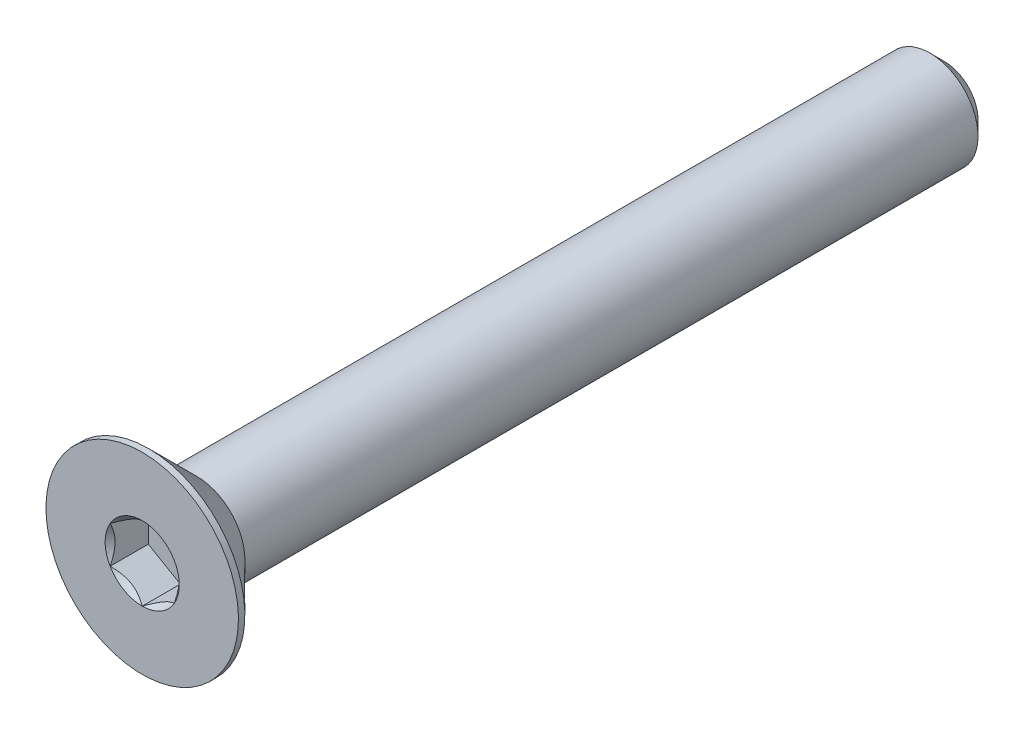
ISO-10303-21;
HEADER;
FILE_DESCRIPTION(('STEP AP214'),'2;1');
FILE_NAME('part.step','',(''),(''),'','','');
FILE_SCHEMA(('AUTOMOTIVE_DESIGN { 1 0 10303 214 1 1 1 1 }'));
ENDSEC;
DATA;
#1=APPLICATION_CONTEXT('core data for automotive mechanical design processes');
#2=APPLICATION_PROTOCOL_DEFINITION('international standard','automotive_design',2000,#1);
#3=PRODUCT_CONTEXT('',#1,'mechanical');
#4=PRODUCT('Part','Part','',(#3));
#5=PRODUCT_RELATED_PRODUCT_CATEGORY('part','',(#4));
#6=PRODUCT_DEFINITION_FORMATION('','',#4);
#7=PRODUCT_DEFINITION_CONTEXT('part definition',#1,'design');
#8=PRODUCT_DEFINITION('design','',#6,#7);
#9=PRODUCT_DEFINITION_SHAPE('','',#8);
#10=(LENGTH_UNIT() NAMED_UNIT(*) SI_UNIT(.MILLI.,.METRE.));
#11=(NAMED_UNIT(*) PLANE_ANGLE_UNIT() SI_UNIT($,.RADIAN.));
#12=(NAMED_UNIT(*) SI_UNIT($,.STERADIAN.) SOLID_ANGLE_UNIT());
#13=UNCERTAINTY_MEASURE_WITH_UNIT(LENGTH_MEASURE(1.E-05),#10,'distance_accuracy_value','');
#14=(GEOMETRIC_REPRESENTATION_CONTEXT(3) GLOBAL_UNCERTAINTY_ASSIGNED_CONTEXT((#13)) GLOBAL_UNIT_ASSIGNED_CONTEXT((#10,
#11,#12)) REPRESENTATION_CONTEXT('',''));
#15=CARTESIAN_POINT('',(0.,0.,0.));
#16=DIRECTION('',(0.,0.,1.));
#17=DIRECTION('',(1.,0.,0.));
#18=AXIS2_PLACEMENT_3D('',#15,#16,#17);
#19=CARTESIAN_POINT('',(0.,0.,-12.5));
#20=DIRECTION('',(0.,0.,-1.));
#21=DIRECTION('',(0.,1.,0.));
#22=AXIS2_PLACEMENT_3D('',#19,#20,#21);
#23=CYLINDRICAL_SURFACE('',#22,1.5);
#24=CARTESIAN_POINT('',(0.,0.,10.8));
#25=DIRECTION('',(0.,0.,-1.));
#26=DIRECTION('',(0.,1.,0.));
#27=AXIS2_PLACEMENT_3D('',#24,#25,#26);
#28=CIRCLE('',#27,1.5);
#29=CARTESIAN_POINT('',(0.,1.5,10.8));
#30=VERTEX_POINT('',#29);
#31=EDGE_CURVE('E11',#30,#30,#28,.F.);
#32=ORIENTED_EDGE('',*,*,#31,.F.);
#33=EDGE_LOOP('',(#32));
#34=FACE_BOUND('',#33,.T.);
#35=CARTESIAN_POINT('',(0.,0.,-12.05));
#36=DIRECTION('',(0.,0.,-1.));
#37=DIRECTION('',(0.,1.,0.));
#38=AXIS2_PLACEMENT_3D('',#35,#36,#37);
#39=CIRCLE('',#38,1.5);
#40=CARTESIAN_POINT('',(0.,1.5,-12.05));
#41=VERTEX_POINT('',#40);
#42=EDGE_CURVE('E47',#41,#41,#39,.F.);
#43=ORIENTED_EDGE('',*,*,#42,.T.);
#44=EDGE_LOOP('',(#43));
#45=FACE_BOUND('',#44,.T.);
#46=ADVANCED_FACE('F39',(#34,#45),#23,.T.);
#47=CARTESIAN_POINT('',(0.,1.5,-12.5));
#48=DIRECTION('',(0.,0.,-1.));
#49=DIRECTION('',(0.,1.,0.));
#50=AXIS2_PLACEMENT_3D('',#47,#48,#49);
#51=PLANE('',#50);
#52=CARTESIAN_POINT('',(0.,0.,-12.5));
#53=DIRECTION('',(0.,0.,-1.));
#54=DIRECTION('',(0.,1.,0.));
#55=AXIS2_PLACEMENT_3D('',#52,#53,#54);
#56=CIRCLE('',#55,1.05);
#57=CARTESIAN_POINT('',(0.,1.05,-12.5));
#58=VERTEX_POINT('',#57);
#59=EDGE_CURVE('E151',#58,#58,#56,.T.);
#60=ORIENTED_EDGE('',*,*,#59,.T.);
#61=EDGE_LOOP('',(#60));
#62=FACE_BOUND('',#61,.T.);
#63=ADVANCED_FACE('F160',(#62),#51,.T.);
#64=CARTESIAN_POINT('',(0.,0.,-12.5));
#65=DIRECTION('',(0.,0.,1.));
#66=DIRECTION('',(0.,-1.,0.));
#67=AXIS2_PLACEMENT_3D('',#64,#65,#66);
#68=CONICAL_SURFACE('',#67,1.05,0.785398163397446);
#69=ORIENTED_EDGE('',*,*,#42,.F.);
#70=EDGE_LOOP('',(#69));
#71=FACE_BOUND('',#70,.T.);
#72=ORIENTED_EDGE('',*,*,#59,.F.);
#73=EDGE_LOOP('',(#72));
#74=FACE_BOUND('',#73,.T.);
#75=ADVANCED_FACE('F41',(#71,#74),#68,.T.);
#76=CARTESIAN_POINT('',(0.,0.,-12.5));
#77=DIRECTION('',(0.,0.,-1.));
#78=DIRECTION('',(0.,1.,0.));
#79=AXIS2_PLACEMENT_3D('',#76,#77,#78);
#80=CYLINDRICAL_SURFACE('',#79,3.);
#81=CARTESIAN_POINT('',(0.,0.,12.5));
#82=DIRECTION('',(0.,0.,-1.));
#83=DIRECTION('',(0.,1.,0.));
#84=AXIS2_PLACEMENT_3D('',#81,#82,#83);
#85=CIRCLE('',#84,3.);
#86=CARTESIAN_POINT('',(0.,3.,12.5));
#87=VERTEX_POINT('',#86);
#88=EDGE_CURVE('E131',#87,#87,#85,.T.);
#89=ORIENTED_EDGE('',*,*,#88,.T.);
#90=EDGE_LOOP('',(#89));
#91=FACE_BOUND('',#90,.T.);
#92=CARTESIAN_POINT('',(0.,0.,12.3));
#93=DIRECTION('',(0.,0.,-1.));
#94=DIRECTION('',(0.,1.,0.));
#95=AXIS2_PLACEMENT_3D('',#92,#93,#94);
#96=CIRCLE('',#95,3.);
#97=CARTESIAN_POINT('',(0.,3.,12.3));
#98=VERTEX_POINT('',#97);
#99=EDGE_CURVE('E128',#98,#98,#96,.T.);
#100=ORIENTED_EDGE('',*,*,#99,.F.);
#101=EDGE_LOOP('',(#100));
#102=FACE_BOUND('',#101,.T.);
#103=ADVANCED_FACE('F159',(#91,#102),#80,.T.);
#104=CARTESIAN_POINT('',(0.,0.,10.8));
#105=DIRECTION('',(0.,0.,1.));
#106=DIRECTION('',(0.,-1.,0.));
#107=AXIS2_PLACEMENT_3D('',#104,#105,#106);
#108=CONICAL_SURFACE('',#107,1.5,0.78539816339745);
#109=ORIENTED_EDGE('',*,*,#99,.T.);
#110=EDGE_LOOP('',(#109));
#111=FACE_BOUND('',#110,.T.);
#112=ORIENTED_EDGE('',*,*,#31,.T.);
#113=EDGE_LOOP('',(#112));
#114=FACE_BOUND('',#113,.T.);
#115=ADVANCED_FACE('F173',(#111,#114),#108,.T.);
#116=CARTESIAN_POINT('',(0.,0.,12.5));
#117=DIRECTION('',(0.,0.,1.));
#118=DIRECTION('',(0.,-1.,0.));
#119=AXIS2_PLACEMENT_3D('',#116,#117,#118);
#120=PLANE('',#119);
#121=CARTESIAN_POINT('',(0.,0.,12.5));
#122=DIRECTION('',(0.,0.,1.));
#123=DIRECTION('',(1.,0.,0.));
#124=AXIS2_PLACEMENT_3D('',#121,#122,#123);
#125=CIRCLE('',#124,1.15470053837925);
#126=CARTESIAN_POINT('',(1.,0.57735026918963,12.5));
#127=VERTEX_POINT('',#126);
#128=CARTESIAN_POINT('',(0.,1.15470053837926,12.5));
#129=VERTEX_POINT('',#128);
#130=EDGE_CURVE('E98',#127,#129,#125,.T.);
#131=ORIENTED_EDGE('',*,*,#130,.F.);
#132=CARTESIAN_POINT('',(0.,0.,12.5));
#133=DIRECTION('',(0.,0.,1.));
#134=DIRECTION('',(1.,0.,0.));
#135=AXIS2_PLACEMENT_3D('',#132,#133,#134);
#136=CIRCLE('',#135,1.15470053837925);
#137=CARTESIAN_POINT('',(0.999999999999989,-0.577350269189633,12.5));
#138=VERTEX_POINT('',#137);
#139=EDGE_CURVE('E110',#138,#127,#136,.T.);
#140=ORIENTED_EDGE('',*,*,#139,.F.);
#141=CARTESIAN_POINT('',(0.,0.,12.5));
#142=DIRECTION('',(0.,0.,1.));
#143=DIRECTION('',(1.,0.,0.));
#144=AXIS2_PLACEMENT_3D('',#141,#142,#143);
#145=CIRCLE('',#144,1.15470053837925);
#146=CARTESIAN_POINT('',(0.,-1.15470053837924,12.5));
#147=VERTEX_POINT('',#146);
#148=EDGE_CURVE('E244',#147,#138,#145,.T.);
#149=ORIENTED_EDGE('',*,*,#148,.F.);
#150=CARTESIAN_POINT('',(0.,0.,12.5));
#151=DIRECTION('',(0.,0.,1.));
#152=DIRECTION('',(1.,0.,0.));
#153=AXIS2_PLACEMENT_3D('',#150,#151,#152);
#154=CIRCLE('',#153,1.15470053837925);
#155=CARTESIAN_POINT('',(-1.,-0.577350269189614,12.5));
#156=VERTEX_POINT('',#155);
#157=EDGE_CURVE('E123',#156,#147,#154,.T.);
#158=ORIENTED_EDGE('',*,*,#157,.F.);
#159=CARTESIAN_POINT('',(0.,0.,12.5));
#160=DIRECTION('',(0.,0.,1.));
#161=DIRECTION('',(1.,0.,0.));
#162=AXIS2_PLACEMENT_3D('',#159,#160,#161);
#163=CIRCLE('',#162,1.15470053837925);
#164=CARTESIAN_POINT('',(-1.,0.577350269189625,12.5));
#165=VERTEX_POINT('',#164);
#166=EDGE_CURVE('E245',#165,#156,#163,.T.);
#167=ORIENTED_EDGE('',*,*,#166,.F.);
#168=CARTESIAN_POINT('',(0.,0.,12.5));
#169=DIRECTION('',(0.,0.,1.));
#170=DIRECTION('',(1.,0.,0.));
#171=AXIS2_PLACEMENT_3D('',#168,#169,#170);
#172=CIRCLE('',#171,1.15470053837925);
#173=EDGE_CURVE('E113',#129,#165,#172,.T.);
#174=ORIENTED_EDGE('',*,*,#173,.F.);
#175=EDGE_LOOP('',(#131,#140,#149,#158,#167,#174));
#176=FACE_BOUND('',#175,.T.);
#177=ORIENTED_EDGE('',*,*,#88,.F.);
#178=EDGE_LOOP('',(#177));
#179=FACE_BOUND('',#178,.T.);
#180=ADVANCED_FACE('F107',(#176,#179),#120,.T.);
#181=CARTESIAN_POINT('',(1.,0.577350269189626,11.31));
#182=DIRECTION('',(0.5,0.866025403784438,0.));
#183=DIRECTION('',(-0.866025403784439,0.5,0.));
#184=AXIS2_PLACEMENT_3D('',#181,#182,#183);
#185=PLANE('',#184);
#186=DIRECTION('',(0.,0.,1.));
#187=VECTOR('',#186,1.);
#188=CARTESIAN_POINT('',(1.,0.577350269189626,11.31));
#189=LINE('',#188,#187);
#190=CARTESIAN_POINT('',(1.,0.577350269189626,11.31));
#191=VERTEX_POINT('',#190);
#192=EDGE_CURVE('E54',#191,#127,#189,.T.);
#193=ORIENTED_EDGE('',*,*,#192,.T.);
#194=CARTESIAN_POINT('',(-0.000199999999999771,1.15481600843309,12.5001154873726));
#195=CARTESIAN_POINT('',(0.0341825950071806,1.13496520795026,12.4802779308257));
#196=CARTESIAN_POINT('',(0.0691401181398243,1.11478247255942,12.4616050206389));
#197=CARTESIAN_POINT('',(0.140422802956088,1.07362739529219,12.4274147427232));
#198=CARTESIAN_POINT('',(0.176754750528982,1.0526511355808,12.4119164090235));
#199=CARTESIAN_POINT('',(0.250016613803309,1.01035337909803,12.3853673071423));
#200=CARTESIAN_POINT('',(0.286927851445412,0.989042666109243,12.3742497739969));
#201=CARTESIAN_POINT('',(0.361562729310856,0.945952199282694,12.3571198657762));
#202=CARTESIAN_POINT('',(0.399284088108632,0.924173762626599,12.3510946974667));
#203=CARTESIAN_POINT('',(0.46429219841793,0.886641312640017,12.3456605549675));
#204=CARTESIAN_POINT('',(0.491494371528168,0.870936130672278,12.3448569383167));
#205=CARTESIAN_POINT('',(0.545846040669108,0.839556179862851,12.3462066994169));
#206=CARTESIAN_POINT('',(0.572995523754871,0.823881418494927,12.3483607295472));
#207=CARTESIAN_POINT('',(0.654056277326955,0.77708097059937,12.3591169721285));
#208=CARTESIAN_POINT('',(0.707564140978422,0.746188191116434,12.3720145564154));
#209=CARTESIAN_POINT('',(0.801476065143427,0.691968116419653,12.4031407306022));
#210=CARTESIAN_POINT('',(0.842320523671831,0.668386557293374,12.4197377977018));
#211=CARTESIAN_POINT('',(0.922409637381942,0.622147085933683,12.4571249246853));
#212=CARTESIAN_POINT('',(0.961659010870437,0.599486449584576,12.4779013418174));
#213=CARTESIAN_POINT('',(1.0002,0.577234799135788,12.5001154873726));
#214=B_SPLINE_CURVE_WITH_KNOTS('',3,(#194,#195,#196,#197,#198,#199,#200,#201,#202,#203,#204,
#205,#206,#207,#208,#209,#210,#211,#212,#213),.UNSPECIFIED.,.F.,.F.,(4,2,2,2,2,2,2,2,2,4),(0.,
0.133237676828558,0.267252229834488,0.399137076269297,0.530689603280764,0.624814864263841,
0.718960890149128,0.907306626112091,1.05710100361789,1.20641411519286),.UNSPECIFIED.);
#215=EDGE_CURVE('E95',#129,#127,#214,.T.);
#216=ORIENTED_EDGE('',*,*,#215,.F.);
#217=DIRECTION('',(0.,0.,1.));
#218=VECTOR('',#217,1.);
#219=CARTESIAN_POINT('',(0.,1.15470053837925,11.31));
#220=LINE('',#219,#218);
#221=CARTESIAN_POINT('',(0.,1.15470053837925,11.31));
#222=VERTEX_POINT('',#221);
#223=EDGE_CURVE('E147',#222,#129,#220,.T.);
#224=ORIENTED_EDGE('',*,*,#223,.F.);
#225=DIRECTION('',(-0.866025403784439,0.5,0.));
#226=VECTOR('',#225,1.);
#227=CARTESIAN_POINT('',(1.,0.577350269189626,11.31));
#228=LINE('',#227,#226);
#229=EDGE_CURVE('E120',#191,#222,#228,.T.);
#230=ORIENTED_EDGE('',*,*,#229,.F.);
#231=EDGE_LOOP('',(#193,#216,#224,#230));
#232=FACE_BOUND('',#231,.T.);
#233=ADVANCED_FACE('F125',(#232),#185,.F.);
#234=CARTESIAN_POINT('',(1.,-0.577350269189627,11.31));
#235=DIRECTION('',(1.,0.,0.));
#236=DIRECTION('',(0.,0.,-1.));
#237=AXIS2_PLACEMENT_3D('',#234,#235,#236);
#238=PLANE('',#237);
#239=DIRECTION('',(0.,0.,1.));
#240=VECTOR('',#239,1.);
#241=CARTESIAN_POINT('',(1.,-0.577350269189627,11.31));
#242=LINE('',#241,#240);
#243=CARTESIAN_POINT('',(1.,-0.577350269189627,11.31));
#244=VERTEX_POINT('',#243);
#245=EDGE_CURVE('E62',#244,#138,#242,.T.);
#246=ORIENTED_EDGE('',*,*,#245,.T.);
#247=CARTESIAN_POINT('',(1.,-1.15147208646462,12.8703856775139));
#248=CARTESIAN_POINT('',(1.,-1.12343447988553,12.8492199198737));
#249=CARTESIAN_POINT('',(1.,-1.09524064850698,12.8282616921759));
#250=CARTESIAN_POINT('',(1.,-1.03847715644377,12.7868460222356));
#251=CARTESIAN_POINT('',(1.,-1.00990740382976,12.7663887061237));
#252=CARTESIAN_POINT('',(1.,-0.923120894333482,12.7056047949545));
#253=CARTESIAN_POINT('',(1.,-0.864253173759064,12.6661922289614));
#254=CARTESIAN_POINT('',(1.,-0.740809858258049,12.5888206642002));
#255=CARTESIAN_POINT('',(1.,-0.676100255137811,12.5510730391143));
#256=CARTESIAN_POINT('',(1.,-0.543448939049127,12.4820245875513));
#257=CARTESIAN_POINT('',(1.,-0.47551911202778,12.4507020278469));
#258=CARTESIAN_POINT('',(1.,-0.373555850333528,12.4123817788838));
#259=CARTESIAN_POINT('',(1.,-0.341031989670906,12.4013835916422));
#260=CARTESIAN_POINT('',(1.,-0.275199079052291,12.3819983421474));
#261=CARTESIAN_POINT('',(1.,-0.241889975173931,12.3736114597767));
#262=CARTESIAN_POINT('',(1.,-0.17524751704299,12.360025220719));
#263=CARTESIAN_POINT('',(1.,-0.141925568218172,12.354770790768));
#264=CARTESIAN_POINT('',(1.,-0.0749144362322751,12.3475486865709));
#265=CARTESIAN_POINT('',(1.,-0.0412251978501576,12.3455815136105));
#266=CARTESIAN_POINT('',(1.,0.0249580992634258,12.3450831983932));
#267=CARTESIAN_POINT('',(1.,0.0574512826460443,12.3464302678886));
#268=CARTESIAN_POINT('',(1.,0.122148505701872,12.352216484499));
#269=CARTESIAN_POINT('',(1.,0.154352610132932,12.3566549206615));
#270=CARTESIAN_POINT('',(1.,0.218799898867646,12.3684568301452));
#271=CARTESIAN_POINT('',(1.,0.25103374326896,12.3758705410385));
#272=CARTESIAN_POINT('',(1.,0.314797132354925,12.3932289424987));
#273=CARTESIAN_POINT('',(1.,0.346326735731011,12.4031734212888));
#274=CARTESIAN_POINT('',(1.,0.445594187730212,12.4382234825543));
#275=CARTESIAN_POINT('',(1.,0.511919139476043,12.4673208583567));
#276=CARTESIAN_POINT('',(1.,0.641453244657538,12.5320153296865));
#277=CARTESIAN_POINT('',(1.,0.70465013312635,12.5676357767152));
#278=CARTESIAN_POINT('',(1.,0.825428490174993,12.6411239013469));
#279=CARTESIAN_POINT('',(1.,0.883132947867691,12.6787919471355));
#280=CARTESIAN_POINT('',(1.,0.968148853704571,12.7370228529432));
#281=CARTESIAN_POINT('',(1.,0.996120570380291,12.7566384757629));
#282=CARTESIAN_POINT('',(1.,1.05168177729902,12.7963885170613));
#283=CARTESIAN_POINT('',(1.,1.07927136997701,12.8165227921988));
#284=CARTESIAN_POINT('',(1.,1.1067018534633,12.836872119073));
#285=B_SPLINE_CURVE_WITH_KNOTS('',3,(#247,#248,#249,#250,#251,#252,#253,#254,#255,#256,#257,
#258,#259,#260,#261,#262,#263,#264,#265,#266,#267,#268,#269,#270,#271,#272,#273,#274,#275,#276,
#277,#278,#279,#280,#281,#282,#283,#284),.UNSPECIFIED.,.F.,.F.,(4,2,2,2,2,2,2,2,2,2,2,2,2,2,2,2,
2,2,4),(0.,0.105386459083291,0.210799187330127,0.423233611565474,0.64779354090851,
0.871580877738621,0.974493074181434,1.07741235827203,1.17846428203206,1.27953161415764,
1.37694086739612,1.4743277258541,1.57343322804295,1.67253043972853,1.88917353996829,
2.10660791038815,2.31323734249845,2.41572589232046,2.51818641476505),.UNSPECIFIED.);
#286=EDGE_CURVE('E119',#127,#138,#285,.F.);
#287=ORIENTED_EDGE('',*,*,#286,.F.);
#288=ORIENTED_EDGE('',*,*,#192,.F.);
#289=DIRECTION('',(0.,1.,0.));
#290=VECTOR('',#289,1.);
#291=CARTESIAN_POINT('',(1.,-0.577350269189627,11.31));
#292=LINE('',#291,#290);
#293=EDGE_CURVE('E136',#244,#191,#292,.T.);
#294=ORIENTED_EDGE('',*,*,#293,.F.);
#295=EDGE_LOOP('',(#246,#287,#288,#294));
#296=FACE_BOUND('',#295,.T.);
#297=ADVANCED_FACE('F122',(#296),#238,.F.);
#298=CARTESIAN_POINT('',(0.,-1.15470053837925,11.31));
#299=DIRECTION('',(0.5,-0.866025403784439,0.));
#300=DIRECTION('',(0.866025403784439,0.5,0.));
#301=AXIS2_PLACEMENT_3D('',#298,#299,#300);
#302=PLANE('',#301);
#303=DIRECTION('',(0.,0.,1.));
#304=VECTOR('',#303,1.);
#305=CARTESIAN_POINT('',(0.,-1.15470053837925,11.31));
#306=LINE('',#305,#304);
#307=CARTESIAN_POINT('',(0.,-1.15470053837925,11.31));
#308=VERTEX_POINT('',#307);
#309=EDGE_CURVE('E133',#308,#147,#306,.T.);
#310=ORIENTED_EDGE('',*,*,#309,.T.);
#311=CARTESIAN_POINT('',(1.0002,-0.577234799135789,12.5001154873726));
#312=CARTESIAN_POINT('',(0.965817404992819,-0.597085599618622,12.4802779308257));
#313=CARTESIAN_POINT('',(0.930859881860175,-0.617268335009457,12.4616050206389));
#314=CARTESIAN_POINT('',(0.859577197043911,-0.658423412276686,12.4274147427232));
#315=CARTESIAN_POINT('',(0.823245249471017,-0.67939967198808,12.4119164090235));
#316=CARTESIAN_POINT('',(0.74998338619669,-0.721697428470846,12.3853673071423));
#317=CARTESIAN_POINT('',(0.713072148554587,-0.743008141459636,12.3742497739969));
#318=CARTESIAN_POINT('',(0.638437270689143,-0.786098608286185,12.3571198657762));
#319=CARTESIAN_POINT('',(0.600715911891366,-0.80787704494228,12.3510946974667));
#320=CARTESIAN_POINT('',(0.535707801582069,-0.845409494928862,12.3456605549675));
#321=CARTESIAN_POINT('',(0.50850562847183,-0.861114676896601,12.3448569383167));
#322=CARTESIAN_POINT('',(0.45415395933089,-0.892494627706028,12.3462066994169));
#323=CARTESIAN_POINT('',(0.427004476245126,-0.908169389073953,12.3483607295472));
#324=CARTESIAN_POINT('',(0.345943722673041,-0.95496983696951,12.3591169721285));
#325=CARTESIAN_POINT('',(0.292435859021573,-0.985862616452447,12.3720145564154));
#326=CARTESIAN_POINT('',(0.198523934856569,-1.04008269114923,12.4031407306022));
#327=CARTESIAN_POINT('',(0.157679476328166,-1.06366425027551,12.4197377977018));
#328=CARTESIAN_POINT('',(0.0775903626180571,-1.1099037216352,12.4571249246853));
#329=CARTESIAN_POINT('',(0.0383409891295629,-1.1325643579843,12.4779013418174));
#330=CARTESIAN_POINT('',(-0.000199999999999964,-1.15481600843309,12.5001154873726));
#331=B_SPLINE_CURVE_WITH_KNOTS('',3,(#311,#312,#313,#314,#315,#316,#317,#318,#319,#320,#321,
#322,#323,#324,#325,#326,#327,#328,#329,#330),.UNSPECIFIED.,.F.,.F.,(4,2,2,2,2,2,2,2,2,4),(0.,
0.133237676828559,0.267252229834488,0.399137076269297,0.530689603280764,0.624814864263842,
0.71896089014913,0.907306626112095,1.05710100361789,1.20641411519286),.UNSPECIFIED.);
#332=EDGE_CURVE('E242',#138,#147,#331,.T.);
#333=ORIENTED_EDGE('',*,*,#332,.F.);
#334=ORIENTED_EDGE('',*,*,#245,.F.);
#335=DIRECTION('',(0.866025403784439,0.5,0.));
#336=VECTOR('',#335,1.);
#337=CARTESIAN_POINT('',(0.,-1.15470053837925,11.31));
#338=LINE('',#337,#336);
#339=EDGE_CURVE('E234',#308,#244,#338,.T.);
#340=ORIENTED_EDGE('',*,*,#339,.F.);
#341=EDGE_LOOP('',(#310,#333,#334,#340));
#342=FACE_BOUND('',#341,.T.);
#343=ADVANCED_FACE('F199',(#342),#302,.F.);
#344=CARTESIAN_POINT('',(-1.,-0.577350269189626,11.31));
#345=DIRECTION('',(-0.5,-0.866025403784439,0.));
#346=DIRECTION('',(0.866025403784439,-0.5,0.));
#347=AXIS2_PLACEMENT_3D('',#344,#345,#346);
#348=PLANE('',#347);
#349=DIRECTION('',(0.,0.,1.));
#350=VECTOR('',#349,1.);
#351=CARTESIAN_POINT('',(-1.,-0.577350269189626,11.31));
#352=LINE('',#351,#350);
#353=CARTESIAN_POINT('',(-1.,-0.577350269189626,11.31));
#354=VERTEX_POINT('',#353);
#355=EDGE_CURVE('E141',#354,#156,#352,.T.);
#356=ORIENTED_EDGE('',*,*,#355,.T.);
#357=CARTESIAN_POINT('',(0.000199999999999887,-1.15481600843309,12.5001154873726));
#358=CARTESIAN_POINT('',(-0.0341825950071811,-1.13496520795026,12.4802779308257));
#359=CARTESIAN_POINT('',(-0.0691401181398254,-1.11478247255942,12.4616050206389));
#360=CARTESIAN_POINT('',(-0.140422802956091,-1.07362739529219,12.4274147427232));
#361=CARTESIAN_POINT('',(-0.176754750528985,-1.0526511355808,12.4119164090235));
#362=CARTESIAN_POINT('',(-0.250016613803313,-1.01035337909803,12.3853673071423));
#363=CARTESIAN_POINT('',(-0.286927851445416,-0.98904266610924,12.3742497739969));
#364=CARTESIAN_POINT('',(-0.361562729310861,-0.94595219928269,12.3571198657762));
#365=CARTESIAN_POINT('',(-0.399284088108638,-0.924173762626595,12.3510946974667));
#366=CARTESIAN_POINT('',(-0.464292198417936,-0.886641312640013,12.3456605549675));
#367=CARTESIAN_POINT('',(-0.491494371528175,-0.870936130672274,12.3448569383167));
#368=CARTESIAN_POINT('',(-0.545846040669115,-0.839556179862847,12.3462066994169));
#369=CARTESIAN_POINT('',(-0.572995523754879,-0.823881418494922,12.3483607295472));
#370=CARTESIAN_POINT('',(-0.654056277326964,-0.777080970599365,12.3591169721285));
#371=CARTESIAN_POINT('',(-0.707564140978432,-0.746188191116428,12.3720145564154));
#372=CARTESIAN_POINT('',(-0.801476065143435,-0.691968116419648,12.4031407306022));
#373=CARTESIAN_POINT('',(-0.842320523671837,-0.66838655729337,12.4197377977018));
#374=CARTESIAN_POINT('',(-0.922409637381945,-0.622147085933681,12.4571249246853));
#375=CARTESIAN_POINT('',(-0.961659010870438,-0.599486449584575,12.4779013418174));
#376=CARTESIAN_POINT('',(-1.0002,-0.577234799135788,12.5001154873726));
#377=B_SPLINE_CURVE_WITH_KNOTS('',3,(#357,#358,#359,#360,#361,#362,#363,#364,#365,#366,#367,
#368,#369,#370,#371,#372,#373,#374,#375,#376),.UNSPECIFIED.,.F.,.F.,(4,2,2,2,2,2,2,2,2,4),(0.,
0.13323767682856,0.267252229834491,0.399137076269302,0.530689603280771,0.624814864263849,
0.718960890149137,0.907306626112102,1.0571010036179,1.20641411519286),.UNSPECIFIED.);
#378=EDGE_CURVE('E216',#147,#156,#377,.T.);
#379=ORIENTED_EDGE('',*,*,#378,.F.);
#380=ORIENTED_EDGE('',*,*,#309,.F.);
#381=DIRECTION('',(0.866025403784439,-0.5,0.));
#382=VECTOR('',#381,1.);
#383=CARTESIAN_POINT('',(-1.,-0.577350269189626,11.31));
#384=LINE('',#383,#382);
#385=EDGE_CURVE('E232',#354,#308,#384,.T.);
#386=ORIENTED_EDGE('',*,*,#385,.F.);
#387=EDGE_LOOP('',(#356,#379,#380,#386));
#388=FACE_BOUND('',#387,.T.);
#389=ADVANCED_FACE('F195',(#388),#348,.F.);
#390=CARTESIAN_POINT('',(-1.,0.577350269189626,11.31));
#391=DIRECTION('',(-1.,0.,0.));
#392=DIRECTION('',(0.,-1.,0.));
#393=AXIS2_PLACEMENT_3D('',#390,#391,#392);
#394=PLANE('',#393);
#395=DIRECTION('',(0.,0.,1.));
#396=VECTOR('',#395,1.);
#397=CARTESIAN_POINT('',(-1.,0.577350269189626,11.31));
#398=LINE('',#397,#396);
#399=CARTESIAN_POINT('',(-1.,0.577350269189626,11.31));
#400=VERTEX_POINT('',#399);
#401=EDGE_CURVE('E144',#400,#165,#398,.T.);
#402=ORIENTED_EDGE('',*,*,#401,.T.);
#403=CARTESIAN_POINT('',(-1.,-1.15147208646462,12.8703856775139));
#404=CARTESIAN_POINT('',(-1.,-1.12343447988552,12.8492199198737));
#405=CARTESIAN_POINT('',(-1.,-1.09524064850698,12.8282616921759));
#406=CARTESIAN_POINT('',(-1.,-1.03847715644377,12.7868460222356));
#407=CARTESIAN_POINT('',(-1.,-1.00990740382975,12.7663887061237));
#408=CARTESIAN_POINT('',(-1.,-0.92312089433348,12.7056047949545));
#409=CARTESIAN_POINT('',(-1.,-0.864253173759062,12.6661922289614));
#410=CARTESIAN_POINT('',(-1.,-0.740809858258047,12.5888206642002));
#411=CARTESIAN_POINT('',(-1.,-0.676100255137807,12.5510730391143));
#412=CARTESIAN_POINT('',(-1.,-0.543448939049124,12.4820245875513));
#413=CARTESIAN_POINT('',(-1.,-0.475519112027778,12.4507020278469));
#414=CARTESIAN_POINT('',(-1.,-0.373555850333527,12.4123817788838));
#415=CARTESIAN_POINT('',(-1.,-0.341031989670906,12.4013835916422));
#416=CARTESIAN_POINT('',(-1.,-0.27519907905229,12.3819983421474));
#417=CARTESIAN_POINT('',(-1.,-0.24188997517393,12.3736114597767));
#418=CARTESIAN_POINT('',(-1.,-0.175247517042989,12.360025220719));
#419=CARTESIAN_POINT('',(-1.,-0.141925568218171,12.354770790768));
#420=CARTESIAN_POINT('',(-1.,-0.0749144362322744,12.3475486865709));
#421=CARTESIAN_POINT('',(-1.,-0.0412251978501568,12.3455815136105));
#422=CARTESIAN_POINT('',(-1.,0.0249580992634265,12.3450831983932));
#423=CARTESIAN_POINT('',(-1.,0.057451282646045,12.3464302678886));
#424=CARTESIAN_POINT('',(-1.,0.122148505701873,12.352216484499));
#425=CARTESIAN_POINT('',(-1.,0.154352610132933,12.3566549206615));
#426=CARTESIAN_POINT('',(-1.,0.218799898867646,12.3684568301452));
#427=CARTESIAN_POINT('',(-1.,0.25103374326896,12.3758705410385));
#428=CARTESIAN_POINT('',(-1.,0.314797132354926,12.3932289424987));
#429=CARTESIAN_POINT('',(-1.,0.346326735731011,12.4031734212888));
#430=CARTESIAN_POINT('',(-1.,0.445594187730212,12.4382234825543));
#431=CARTESIAN_POINT('',(-1.,0.511919139476043,12.4673208583567));
#432=CARTESIAN_POINT('',(-1.,0.641453244657538,12.5320153296865));
#433=CARTESIAN_POINT('',(-1.,0.70465013312635,12.5676357767152));
#434=CARTESIAN_POINT('',(-1.,0.825428490174992,12.6411239013469));
#435=CARTESIAN_POINT('',(-1.,0.88313294786769,12.6787919471355));
#436=CARTESIAN_POINT('',(-1.,0.968148853704571,12.7370228529432));
#437=CARTESIAN_POINT('',(-1.,0.99612057038029,12.7566384757629));
#438=CARTESIAN_POINT('',(-1.,1.05168177729902,12.7963885170613));
#439=CARTESIAN_POINT('',(-1.,1.07927136997701,12.8165227921988));
#440=CARTESIAN_POINT('',(-1.,1.1067018534633,12.836872119073));
#441=B_SPLINE_CURVE_WITH_KNOTS('',3,(#403,#404,#405,#406,#407,#408,#409,#410,#411,#412,#413,
#414,#415,#416,#417,#418,#419,#420,#421,#422,#423,#424,#425,#426,#427,#428,#429,#430,#431,#432,
#433,#434,#435,#436,#437,#438,#439,#440),.UNSPECIFIED.,.F.,.F.,(4,2,2,2,2,2,2,2,2,2,2,2,2,2,2,2,
2,2,4),(0.,0.10538645908329,0.210799187330125,0.423233611565474,0.64779354090851,
0.871580877738619,0.974493074181431,1.07741235827202,1.17846428203206,1.27953161415764,
1.37694086739612,1.47432772585409,1.57343322804295,1.67253043972853,1.88917353996829,
2.10660791038814,2.31323734249845,2.41572589232046,2.51818641476505),.UNSPECIFIED.);
#442=EDGE_CURVE('E101',#156,#165,#441,.T.);
#443=ORIENTED_EDGE('',*,*,#442,.F.);
#444=ORIENTED_EDGE('',*,*,#355,.F.);
#445=DIRECTION('',(0.,-1.,0.));
#446=VECTOR('',#445,1.);
#447=CARTESIAN_POINT('',(-1.,0.577350269189626,11.31));
#448=LINE('',#447,#446);
#449=EDGE_CURVE('E229',#400,#354,#448,.T.);
#450=ORIENTED_EDGE('',*,*,#449,.F.);
#451=EDGE_LOOP('',(#402,#443,#444,#450));
#452=FACE_BOUND('',#451,.T.);
#453=ADVANCED_FACE('F191',(#452),#394,.F.);
#454=CARTESIAN_POINT('',(0.,1.15470053837925,11.31));
#455=DIRECTION('',(-0.5,0.866025403784439,0.));
#456=DIRECTION('',(-0.866025403784439,-0.5,0.));
#457=AXIS2_PLACEMENT_3D('',#454,#455,#456);
#458=PLANE('',#457);
#459=ORIENTED_EDGE('',*,*,#223,.T.);
#460=CARTESIAN_POINT('',(-1.0002,0.577234799135788,12.5001154873726));
#461=CARTESIAN_POINT('',(-0.96581740499282,0.597085599618622,12.4802779308257));
#462=CARTESIAN_POINT('',(-0.930859881860176,0.617268335009457,12.4616050206389));
#463=CARTESIAN_POINT('',(-0.859577197043911,0.658423412276686,12.4274147427232));
#464=CARTESIAN_POINT('',(-0.823245249471016,0.67939967198808,12.4119164090235));
#465=CARTESIAN_POINT('',(-0.749983386196688,0.721697428470847,12.3853673071423));
#466=CARTESIAN_POINT('',(-0.713072148554585,0.743008141459637,12.3742497739969));
#467=CARTESIAN_POINT('',(-0.63843727068914,0.786098608286187,12.3571198657762));
#468=CARTESIAN_POINT('',(-0.600715911891363,0.807877044942282,12.3510946974667));
#469=CARTESIAN_POINT('',(-0.535707801582065,0.845409494928864,12.3456605549675));
#470=CARTESIAN_POINT('',(-0.508505628471827,0.861114676896603,12.3448569383167));
#471=CARTESIAN_POINT('',(-0.454153959330887,0.89249462770603,12.3462066994169));
#472=CARTESIAN_POINT('',(-0.427004476245123,0.908169389073955,12.3483607295472));
#473=CARTESIAN_POINT('',(-0.345943722673039,0.954969836969511,12.3591169721285));
#474=CARTESIAN_POINT('',(-0.292435859021572,0.985862616452448,12.3720145564154));
#475=CARTESIAN_POINT('',(-0.198523934856568,1.04008269114923,12.4031407306022));
#476=CARTESIAN_POINT('',(-0.157679476328166,1.06366425027551,12.4197377977018));
#477=CARTESIAN_POINT('',(-0.0775903626180558,1.1099037216352,12.4571249246853));
#478=CARTESIAN_POINT('',(-0.0383409891295616,1.1325643579843,12.4779013418174));
#479=CARTESIAN_POINT('',(0.000200000000000537,1.15481600843309,12.5001154873726));
#480=B_SPLINE_CURVE_WITH_KNOTS('',3,(#460,#461,#462,#463,#464,#465,#466,#467,#468,#469,#470,
#471,#472,#473,#474,#475,#476,#477,#478,#479),.UNSPECIFIED.,.F.,.F.,(4,2,2,2,2,2,2,2,2,4),(0.,
0.13323767682856,0.267252229834491,0.399137076269302,0.530689603280771,0.624814864263848,
0.718960890149135,0.907306626112098,1.0571010036179,1.20641411519286),.UNSPECIFIED.);
#481=EDGE_CURVE('E238',#165,#129,#480,.T.);
#482=ORIENTED_EDGE('',*,*,#481,.F.);
#483=ORIENTED_EDGE('',*,*,#401,.F.);
#484=DIRECTION('',(-0.866025403784439,-0.5,0.));
#485=VECTOR('',#484,1.);
#486=CARTESIAN_POINT('',(0.,1.15470053837925,11.31));
#487=LINE('',#486,#485);
#488=EDGE_CURVE('E226',#222,#400,#487,.T.);
#489=ORIENTED_EDGE('',*,*,#488,.F.);
#490=EDGE_LOOP('',(#459,#482,#483,#489));
#491=FACE_BOUND('',#490,.T.);
#492=ADVANCED_FACE('F187',(#491),#458,.F.);
#493=CARTESIAN_POINT('',(0.,0.,11.31));
#494=DIRECTION('',(0.,0.,1.));
#495=DIRECTION('',(1.,0.,0.));
#496=AXIS2_PLACEMENT_3D('',#493,#494,#495);
#497=PLANE('',#496);
#498=ORIENTED_EDGE('',*,*,#229,.T.);
#499=ORIENTED_EDGE('',*,*,#488,.T.);
#500=ORIENTED_EDGE('',*,*,#449,.T.);
#501=ORIENTED_EDGE('',*,*,#385,.T.);
#502=ORIENTED_EDGE('',*,*,#339,.T.);
#503=ORIENTED_EDGE('',*,*,#293,.T.);
#504=EDGE_LOOP('',(#498,#499,#500,#501,#502,#503));
#505=FACE_BOUND('',#504,.T.);
#506=ADVANCED_FACE('F190',(#505),#497,.T.);
#507=CARTESIAN_POINT('',(0.,0.,12.5));
#508=DIRECTION('',(0.,0.,1.));
#509=DIRECTION('',(1.,0.,0.));
#510=AXIS2_PLACEMENT_3D('',#507,#508,#509);
#511=CONICAL_SURFACE('',#510,1.15470053837925,0.78539816339745);
#512=ORIENTED_EDGE('',*,*,#481,.T.);
#513=ORIENTED_EDGE('',*,*,#173,.T.);
#514=EDGE_LOOP('',(#512,#513));
#515=FACE_BOUND('',#514,.T.);
#516=ADVANCED_FACE('F206',(#515),#511,.F.);
#517=CARTESIAN_POINT('',(0.,0.,12.5));
#518=DIRECTION('',(0.,0.,1.));
#519=DIRECTION('',(1.,0.,0.));
#520=AXIS2_PLACEMENT_3D('',#517,#518,#519);
#521=CONICAL_SURFACE('',#520,1.15470053837925,0.78539816339745);
#522=ORIENTED_EDGE('',*,*,#378,.T.);
#523=ORIENTED_EDGE('',*,*,#157,.T.);
#524=EDGE_LOOP('',(#522,#523));
#525=FACE_BOUND('',#524,.T.);
#526=ADVANCED_FACE('F208',(#525),#521,.F.);
#527=CARTESIAN_POINT('',(0.,0.,12.5));
#528=DIRECTION('',(0.,0.,1.));
#529=DIRECTION('',(1.,0.,0.));
#530=AXIS2_PLACEMENT_3D('',#527,#528,#529);
#531=CONICAL_SURFACE('',#530,1.15470053837925,0.78539816339745);
#532=ORIENTED_EDGE('',*,*,#286,.T.);
#533=ORIENTED_EDGE('',*,*,#139,.T.);
#534=EDGE_LOOP('',(#532,#533));
#535=FACE_BOUND('',#534,.T.);
#536=ADVANCED_FACE('F118',(#535),#531,.F.);
#537=CARTESIAN_POINT('',(0.,0.,12.5));
#538=DIRECTION('',(0.,0.,1.));
#539=DIRECTION('',(1.,0.,0.));
#540=AXIS2_PLACEMENT_3D('',#537,#538,#539);
#541=CONICAL_SURFACE('',#540,1.15470053837925,0.78539816339745);
#542=ORIENTED_EDGE('',*,*,#332,.T.);
#543=ORIENTED_EDGE('',*,*,#148,.T.);
#544=EDGE_LOOP('',(#542,#543));
#545=FACE_BOUND('',#544,.T.);
#546=ADVANCED_FACE('F257',(#545),#541,.F.);
#547=CARTESIAN_POINT('',(0.,0.,12.5));
#548=DIRECTION('',(0.,0.,1.));
#549=DIRECTION('',(1.,0.,0.));
#550=AXIS2_PLACEMENT_3D('',#547,#548,#549);
#551=CONICAL_SURFACE('',#550,1.15470053837925,0.78539816339745);
#552=ORIENTED_EDGE('',*,*,#442,.T.);
#553=ORIENTED_EDGE('',*,*,#166,.T.);
#554=EDGE_LOOP('',(#552,#553));
#555=FACE_BOUND('',#554,.T.);
#556=ADVANCED_FACE('F262',(#555),#551,.F.);
#557=CARTESIAN_POINT('',(0.,0.,12.5));
#558=DIRECTION('',(0.,0.,1.));
#559=DIRECTION('',(1.,0.,0.));
#560=AXIS2_PLACEMENT_3D('',#557,#558,#559);
#561=CONICAL_SURFACE('',#560,1.15470053837925,0.78539816339745);
#562=ORIENTED_EDGE('',*,*,#215,.T.);
#563=ORIENTED_EDGE('',*,*,#130,.T.);
#564=EDGE_LOOP('',(#562,#563));
#565=FACE_BOUND('',#564,.T.);
#566=ADVANCED_FACE('F97',(#565),#561,.F.);
#567=CLOSED_SHELL('',(#46,#63,#75,#103,#115,#180,#233,#297,#343,#389,#453,#492,#506,#516,#526,
#536,#546,#556,#566));
#568=MANIFOLD_SOLID_BREP('B2',#567);
#569=ADVANCED_BREP_SHAPE_REPRESENTATION('',(#18,#568),#14);
#570=SHAPE_DEFINITION_REPRESENTATION(#9,#569);
ENDSEC;
END-ISO-10303-21;
